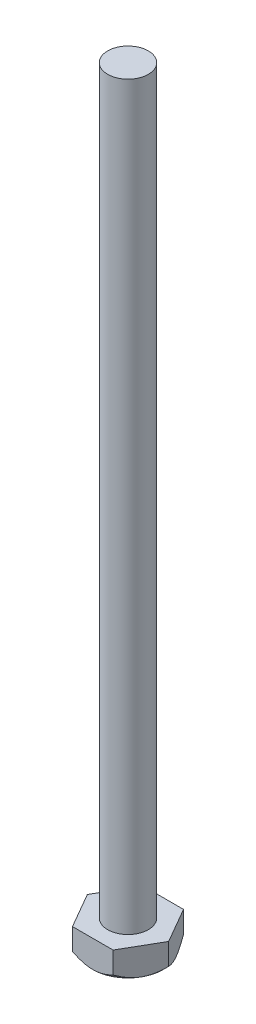
ISO-10303-21;
HEADER;
FILE_DESCRIPTION(('STEP AP214'),'2;1');
FILE_NAME('part.step','',(''),(''),'','','');
FILE_SCHEMA(('AUTOMOTIVE_DESIGN { 1 0 10303 214 1 1 1 1 }'));
ENDSEC;
DATA;
#1=APPLICATION_CONTEXT('core data for automotive mechanical design processes');
#2=APPLICATION_PROTOCOL_DEFINITION('international standard','automotive_design',2000,#1);
#3=PRODUCT_CONTEXT('',#1,'mechanical');
#4=PRODUCT('Part','Part','',(#3));
#5=PRODUCT_RELATED_PRODUCT_CATEGORY('part','',(#4));
#6=PRODUCT_DEFINITION_FORMATION('','',#4);
#7=PRODUCT_DEFINITION_CONTEXT('part definition',#1,'design');
#8=PRODUCT_DEFINITION('design','',#6,#7);
#9=PRODUCT_DEFINITION_SHAPE('','',#8);
#10=(LENGTH_UNIT() NAMED_UNIT(*) SI_UNIT(.MILLI.,.METRE.));
#11=(NAMED_UNIT(*) PLANE_ANGLE_UNIT() SI_UNIT($,.RADIAN.));
#12=(NAMED_UNIT(*) SI_UNIT($,.STERADIAN.) SOLID_ANGLE_UNIT());
#13=UNCERTAINTY_MEASURE_WITH_UNIT(LENGTH_MEASURE(1.E-05),#10,'distance_accuracy_value','');
#14=(GEOMETRIC_REPRESENTATION_CONTEXT(3) GLOBAL_UNCERTAINTY_ASSIGNED_CONTEXT((#13)) GLOBAL_UNIT_ASSIGNED_CONTEXT((#10,
#11,#12)) REPRESENTATION_CONTEXT('',''));
#15=CARTESIAN_POINT('',(0.,0.,0.));
#16=DIRECTION('',(0.,0.,1.));
#17=DIRECTION('',(1.,0.,0.));
#18=AXIS2_PLACEMENT_3D('',#15,#16,#17);
#19=CARTESIAN_POINT('',(-2.25000000000004,3.,-3.89711431702995));
#20=DIRECTION('',(0.866025403784441,0.,0.499999999999995));
#21=DIRECTION('',(0.499999999999995,0.,-0.866025403784441));
#22=AXIS2_PLACEMENT_3D('',#19,#20,#21);
#23=PLANE('',#22);
#24=DIRECTION('',(0.,-1.,0.));
#25=VECTOR('',#24,1.);
#26=CARTESIAN_POINT('',(-2.25000000000004,3.,-3.89711431702995));
#27=LINE('',#26,#25);
#28=CARTESIAN_POINT('',(-2.25000000000004,3.,-3.89711431702995));
#29=VERTEX_POINT('',#28);
#30=CARTESIAN_POINT('',(-2.25000000000004,0.602885682970011,-3.89711431702995));
#31=VERTEX_POINT('',#30);
#32=EDGE_CURVE('E223',#29,#31,#27,.T.);
#33=ORIENTED_EDGE('',*,*,#32,.T.);
#34=CARTESIAN_POINT('',(-2.24988452994621,0.60300115746818,-3.89731431702995));
#35=CARTESIAN_POINT('',(-2.28857392340009,0.564315683598842,-3.8303023218538));
#36=CARTESIAN_POINT('',(-2.32755938166385,0.526817058109167,-3.7627775273846));
#37=CARTESIAN_POINT('',(-2.40618341507805,0.454555279874753,-3.62659670681522));
#38=CARTESIAN_POINT('',(-2.44582233286502,0.419793621225151,-3.55794008725114));
#39=CARTESIAN_POINT('',(-2.56617907410039,0.31986029564012,-3.34947609639806));
#40=CARTESIAN_POINT('',(-2.64791981145258,0.2594666574207,-3.20789698625592));
#41=CARTESIAN_POINT('',(-2.81272459802907,0.156039411954947,-2.92244672257489));
#42=CARTESIAN_POINT('',(-2.89574701832528,0.112745349998774,-2.77864767245451));
#43=CARTESIAN_POINT('',(-3.06362512992859,0.0460360621055565,-2.48787425367886));
#44=CARTESIAN_POINT('',(-3.14847567973046,0.0225710650166898,-2.34090879037187));
#45=CARTESIAN_POINT('',(-3.29471210615064,0.0014001148011714,-2.08761986989481));
#46=CARTESIAN_POINT('',(-3.35590957059238,-0.00173316564486741,-1.98162275218732));
#47=CARTESIAN_POINT('',(-3.47820517363958,0.00354847531604555,-1.76980055416729));
#48=CARTESIAN_POINT('',(-3.53930326991011,0.0119674450049006,-1.66397554718099));
#49=CARTESIAN_POINT('',(-3.66092054700145,0.0398733753388013,-1.45332824418062));
#50=CARTESIAN_POINT('',(-3.72143900322301,0.0593727149732711,-1.34850720320923));
#51=CARTESIAN_POINT('',(-3.84143654501015,0.10837495265247,-1.14066536405054));
#52=CARTESIAN_POINT('',(-3.9009157098986,0.137877083706092,-1.03764442847197));
#53=CARTESIAN_POINT('',(-4.00650583131999,0.198574855137438,-0.854756973392748));
#54=CARTESIAN_POINT('',(-4.0528505586315,0.228174631860845,-0.774485551026299));
#55=CARTESIAN_POINT('',(-4.14470803625456,0.292144439286388,-0.615383732728023));
#56=CARTESIAN_POINT('',(-4.1902207612029,0.326514615138544,-0.536553380726601));
#57=CARTESIAN_POINT('',(-4.28027084260395,0.39925472178509,-0.380582064514261));
#58=CARTESIAN_POINT('',(-4.32481076024834,0.437612075019941,-0.303436664189242));
#59=CARTESIAN_POINT('',(-4.4130657627956,0.51782284154873,-0.150574515755275));
#60=CARTESIAN_POINT('',(-4.45678133385683,0.559674109887407,-0.0748569255953326));
#61=CARTESIAN_POINT('',(-4.50011547005384,0.603001157468207,0.000200000000000009));
#62=B_SPLINE_CURVE_WITH_KNOTS('',3,(#34,#35,#36,#37,#38,#39,#40,#41,#42,#43,#44,#45,#46,#47,#48,
#49,#50,#51,#52,#53,#54,#55,#56,#57,#58,#59,#60,#61),.UNSPECIFIED.,.F.,.F.,(4,2,2,2,2,2,2,2,2,2,
2,2,2,4),(0.,0.259511456949191,0.519163611469622,1.04127151253343,1.55508809846443,
2.06761113620425,2.43439809583154,2.80131362229781,3.16863987499371,3.53593796832224,
3.82770408759527,4.1194790864494,4.41036011166254,4.70106385660935),.UNSPECIFIED.);
#63=CARTESIAN_POINT('',(-3.375,0.,-1.94855715851499));
#64=VERTEX_POINT('',#63);
#65=EDGE_CURVE('E63',#31,#64,#62,.T.);
#66=ORIENTED_EDGE('',*,*,#65,.T.);
#67=CARTESIAN_POINT('',(-4.5,0.602885682970039,0.));
#68=VERTEX_POINT('',#67);
#69=EDGE_CURVE('E191',#64,#68,#62,.T.);
#70=ORIENTED_EDGE('',*,*,#69,.T.);
#71=DIRECTION('',(0.,-1.,0.));
#72=VECTOR('',#71,1.);
#73=CARTESIAN_POINT('',(-4.5,3.,0.));
#74=LINE('',#73,#72);
#75=CARTESIAN_POINT('',(-4.5,3.,0.));
#76=VERTEX_POINT('',#75);
#77=EDGE_CURVE('E242',#76,#68,#74,.T.);
#78=ORIENTED_EDGE('',*,*,#77,.F.);
#79=DIRECTION('',(-0.499999999999995,0.,0.866025403784441));
#80=VECTOR('',#79,1.);
#81=CARTESIAN_POINT('',(-2.25000000000004,3.,-3.89711431702995));
#82=LINE('',#81,#80);
#83=EDGE_CURVE('E227',#29,#76,#82,.T.);
#84=ORIENTED_EDGE('',*,*,#83,.F.);
#85=EDGE_LOOP('',(#33,#66,#70,#78,#84));
#86=FACE_BOUND('',#85,.T.);
#87=ADVANCED_FACE('F41',(#86),#23,.F.);
#88=CARTESIAN_POINT('',(-4.5,3.,0.));
#89=DIRECTION('',(0.866025403784438,0.,-0.500000000000001));
#90=DIRECTION('',(-0.500000000000001,0.,-0.866025403784438));
#91=AXIS2_PLACEMENT_3D('',#88,#89,#90);
#92=PLANE('',#91);
#93=ORIENTED_EDGE('',*,*,#77,.T.);
#94=CARTESIAN_POINT('',(-4.50011547005384,0.603001157468207,-0.000200000000000061));
#95=CARTESIAN_POINT('',(-4.46142607659996,0.564315683598869,0.0668119951761429));
#96=CARTESIAN_POINT('',(-4.42244061833619,0.526817058109193,0.134336789645346));
#97=CARTESIAN_POINT('',(-4.34381658492199,0.454555279874777,0.270517610214731));
#98=CARTESIAN_POINT('',(-4.30417766713502,0.419793621225175,0.339174229778811));
#99=CARTESIAN_POINT('',(-4.18382092589965,0.319860295640143,0.547638220631886));
#100=CARTESIAN_POINT('',(-4.10208018854746,0.259466657420722,0.689217330774031));
#101=CARTESIAN_POINT('',(-3.93727540197096,0.156039411954968,0.974667594455061));
#102=CARTESIAN_POINT('',(-3.85425298167475,0.112745349998794,1.11846664457544));
#103=CARTESIAN_POINT('',(-3.68637487007144,0.0460360621055745,1.40924006335109));
#104=CARTESIAN_POINT('',(-3.60152432026957,0.0225710650167067,1.55620552665809));
#105=CARTESIAN_POINT('',(-3.45528789384939,0.00140011480118764,1.80949444713515));
#106=CARTESIAN_POINT('',(-3.39409042940764,-0.00173316564485114,1.91549156484264));
#107=CARTESIAN_POINT('',(-3.27179482636044,0.0035484753160612,2.12731376286267));
#108=CARTESIAN_POINT('',(-3.21069673008991,0.0119674450049156,2.23313876984896));
#109=CARTESIAN_POINT('',(-3.08907945299857,0.0398733753388158,2.44378607284934));
#110=CARTESIAN_POINT('',(-3.028560996777,0.0593727149732858,2.54860711382073));
#111=CARTESIAN_POINT('',(-2.90856345498987,0.108374952652485,2.75644895297942));
#112=CARTESIAN_POINT('',(-2.84908429010141,0.137877083706107,2.85946988855799));
#113=CARTESIAN_POINT('',(-2.74349416868002,0.198574855137453,3.04235734363721));
#114=CARTESIAN_POINT('',(-2.69714944136851,0.22817463186086,3.12262876600366));
#115=CARTESIAN_POINT('',(-2.60529196374544,0.292144439286405,3.28173058430194));
#116=CARTESIAN_POINT('',(-2.55977923879711,0.326514615138562,3.36056093630337));
#117=CARTESIAN_POINT('',(-2.46972915739605,0.399254721785111,3.51653225251571));
#118=CARTESIAN_POINT('',(-2.42518923975166,0.437612075019963,3.59367765284073));
#119=CARTESIAN_POINT('',(-2.3369342372044,0.517822841548755,3.7465398012747));
#120=CARTESIAN_POINT('',(-2.29321866614317,0.559674109887433,3.82225739143464));
#121=CARTESIAN_POINT('',(-2.24988452994615,0.603001157468234,3.89731431702998));
#122=B_SPLINE_CURVE_WITH_KNOTS('',3,(#94,#95,#96,#97,#98,#99,#100,#101,#102,#103,#104,#105,#106,
#107,#108,#109,#110,#111,#112,#113,#114,#115,#116,#117,#118,#119,#120,#121),.UNSPECIFIED.,.F.,
.F.,(4,2,2,2,2,2,2,2,2,2,2,2,2,4),(0.,0.259511456949194,0.519163611469628,1.04127151253344,
1.55508809846445,2.06761113620427,2.43439809583156,2.80131362229784,3.16863987499374,
3.53593796832227,3.8277040875953,4.11947908644945,4.4103601116626,4.70106385660941),.UNSPECIFIED.);
#123=CARTESIAN_POINT('',(-3.37499999999999,0.,1.94855715851495));
#124=VERTEX_POINT('',#123);
#125=EDGE_CURVE('E189',#68,#124,#122,.T.);
#126=ORIENTED_EDGE('',*,*,#125,.T.);
#127=CARTESIAN_POINT('',(-2.24999999999999,0.602885682970066,3.89711431702998));
#128=VERTEX_POINT('',#127);
#129=EDGE_CURVE('E183',#124,#128,#122,.T.);
#130=ORIENTED_EDGE('',*,*,#129,.T.);
#131=DIRECTION('',(0.,-1.,0.));
#132=VECTOR('',#131,1.);
#133=CARTESIAN_POINT('',(-2.24999999999999,3.,3.89711431702998));
#134=LINE('',#133,#132);
#135=CARTESIAN_POINT('',(-2.24999999999999,3.,3.89711431702998));
#136=VERTEX_POINT('',#135);
#137=EDGE_CURVE('E240',#136,#128,#134,.T.);
#138=ORIENTED_EDGE('',*,*,#137,.F.);
#139=DIRECTION('',(0.500000000000001,0.,0.866025403784438));
#140=VECTOR('',#139,1.);
#141=CARTESIAN_POINT('',(-4.5,3.,0.));
#142=LINE('',#141,#140);
#143=EDGE_CURVE('E253',#76,#136,#142,.T.);
#144=ORIENTED_EDGE('',*,*,#143,.F.);
#145=EDGE_LOOP('',(#93,#126,#130,#138,#144));
#146=FACE_BOUND('',#145,.T.);
#147=ADVANCED_FACE('F197',(#146),#92,.F.);
#148=CARTESIAN_POINT('',(-2.24999999999999,3.,3.89711431702998));
#149=DIRECTION('',(0.,0.,-1.));
#150=DIRECTION('',(-1.,0.,0.));
#151=AXIS2_PLACEMENT_3D('',#148,#149,#150);
#152=PLANE('',#151);
#153=ORIENTED_EDGE('',*,*,#137,.T.);
#154=CARTESIAN_POINT('',(-6.85997222864644,3.99254467292652,3.89711431702999));
#155=CARTESIAN_POINT('',(-6.75872004894412,3.90450931202217,3.89711431702999));
#156=CARTESIAN_POINT('',(-6.65723485497251,3.81674191735845,3.89711431702999));
#157=CARTESIAN_POINT('',(-6.4537364104748,3.64181829269082,3.89711431702999));
#158=CARTESIAN_POINT('',(-6.35172315150067,3.55466207251736,3.89711431702999));
#159=CARTESIAN_POINT('',(-6.04471001249466,3.29414825018533,3.89711431702999));
#160=CARTESIAN_POINT('',(-5.83882880607191,3.12182574373336,3.89711431702999));
#161=CARTESIAN_POINT('',(-5.41947564295796,2.77698805930476,3.89711431702999));
#162=CARTESIAN_POINT('',(-5.20593673766898,2.60455400710487,3.89711431702999));
#163=CARTESIAN_POINT('',(-4.77488643132983,2.2648199704903,3.89711431702999));
#164=CARTESIAN_POINT('',(-4.55737603395738,2.09751871679145,3.89711431702999));
#165=CARTESIAN_POINT('',(-4.11677158743131,1.76976355787984,3.89711431702998));
#166=CARTESIAN_POINT('',(-3.89367085331293,1.6093185385476,3.89711431702998));
#167=CARTESIAN_POINT('',(-3.55361805163421,1.37630388850876,3.89711431702998));
#168=CARTESIAN_POINT('',(-3.43931237137392,1.29987402843667,3.89711431702998));
#169=CARTESIAN_POINT('',(-3.20864728176638,1.15018196609729,3.89711431702998));
#170=CARTESIAN_POINT('',(-3.09228800897874,1.07691955431059,3.89711431702998));
#171=CARTESIAN_POINT('',(-2.85805021732411,0.934795137980553,3.89711431702998));
#172=CARTESIAN_POINT('',(-2.74018873657671,0.86590517785101,3.89711431702998));
#173=CARTESIAN_POINT('',(-2.50178862443397,0.732859675355035,3.89711431702998));
#174=CARTESIAN_POINT('',(-2.38124967225006,0.668704704312785,3.89711431702998));
#175=CARTESIAN_POINT('',(-2.13737280821359,0.546392335210151,3.89711431702998));
#176=CARTESIAN_POINT('',(-2.01403943645704,0.488225955894624,3.89711431702998));
#177=CARTESIAN_POINT('',(-1.7641774041417,0.379238229057955,3.89711431702998));
#178=CARTESIAN_POINT('',(-1.63764961907404,0.328414894161285,3.89711431702998));
#179=CARTESIAN_POINT('',(-1.37837666128282,0.234772801074191,3.89711431702998));
#180=CARTESIAN_POINT('',(-1.24555558375378,0.192161263138968,3.89711431702997));
#181=CARTESIAN_POINT('',(-0.976723782142934,0.118455910747037,3.89711431702997));
#182=CARTESIAN_POINT('',(-0.840713569426529,0.0873602630105727,3.89711431702997));
#183=CARTESIAN_POINT('',(-0.567147529867146,0.0387691626064548,3.89711431702997));
#184=CARTESIAN_POINT('',(-0.429607459728064,0.0211867667628479,3.89711431702997));
#185=CARTESIAN_POINT('',(-0.153432484230891,0.00058968948204515,3.89711431702997));
#186=CARTESIAN_POINT('',(-0.0147977123148992,-0.00242674087741944,3.89711431702997));
#187=CARTESIAN_POINT('',(0.262261756890505,0.00635419376116221,3.89711431702997));
#188=CARTESIAN_POINT('',(0.400685518210838,0.0181804406342243,3.89711431702997));
#189=CARTESIAN_POINT('',(0.675611780835354,0.0557810516949724,3.89711431702997));
#190=CARTESIAN_POINT('',(0.812113884804431,0.0815582582501611,3.89711431702997));
#191=CARTESIAN_POINT('',(1.0831684131717,0.145565470000884,3.89711431702997));
#192=CARTESIAN_POINT('',(1.21769925755864,0.183885230879357,3.89711431702997));
#193=CARTESIAN_POINT('',(1.483325931393,0.270858014295512,3.89711431702997));
#194=CARTESIAN_POINT('',(1.61442168621562,0.319511261111828,3.89711431702997));
#195=CARTESIAN_POINT('',(1.90016841788084,0.43621496261043,3.89711431702996));
#196=CARTESIAN_POINT('',(2.05402453299604,0.506194463366237,3.89711431702996));
#197=CARTESIAN_POINT('',(2.35716987014355,0.655504328004548,3.89711431702996));
#198=CARTESIAN_POINT('',(2.50645642068026,0.734840035067124,3.89711431702996));
#199=CARTESIAN_POINT('',(2.80129692467606,0.900790584026616,3.89711431702996));
#200=CARTESIAN_POINT('',(2.94684260269971,0.987420008714851,3.89711431702996));
#201=CARTESIAN_POINT('',(3.23447290564426,1.16614816901466,3.89711431702996));
#202=CARTESIAN_POINT('',(3.37655820249207,1.25824583068463,3.89711431702996));
#203=CARTESIAN_POINT('',(3.65861400374144,1.44722304089241,3.89711431702996));
#204=CARTESIAN_POINT('',(3.79856890581237,1.54412576675115,3.89711431702996));
#205=CARTESIAN_POINT('',(4.07605297023888,1.74134188071222,3.89711431702996));
#206=CARTESIAN_POINT('',(4.21358204609701,1.84165539006066,3.89711431702996));
#207=CARTESIAN_POINT('',(4.48644515394262,2.04488963428453,3.89711431702996));
#208=CARTESIAN_POINT('',(4.62178156094305,2.14780718885647,3.89711431702996));
#209=CARTESIAN_POINT('',(4.8907443910255,2.35585627240593,3.89711431702995));
#210=CARTESIAN_POINT('',(5.02437075692599,2.46098787510893,3.89711431702995));
#211=CARTESIAN_POINT('',(5.44828680963716,2.79918006792363,3.89711431702995));
#212=CARTESIAN_POINT('',(5.7358529081179,3.03565639479908,3.89711431702995));
#213=CARTESIAN_POINT('',(6.16190550240122,3.39334640966446,3.89711431702995));
#214=CARTESIAN_POINT('',(6.30224505256875,3.5123767879147,3.89711431702995));
#215=CARTESIAN_POINT('',(6.58185843864304,3.75161900099287,3.89711431702995));
#216=CARTESIAN_POINT('',(6.72113251072079,3.87183055966444,3.89711431702995));
#217=CARTESIAN_POINT('',(6.85997222864647,3.99254467292652,3.89711431702995));
#218=B_SPLINE_CURVE_WITH_KNOTS('',3,(#154,#155,#156,#157,#158,#159,#160,#161,#162,#163,#164,
#165,#166,#167,#168,#169,#170,#171,#172,#173,#174,#175,#176,#177,#178,#179,#180,#181,#182,#183,
#184,#185,#186,#187,#188,#189,#190,#191,#192,#193,#194,#195,#196,#197,#198,#199,#200,#201,#202,
#203,#204,#205,#206,#207,#208,#209,#210,#211,#212,#213,#214,#215,#216,#217),.UNSPECIFIED.,.F.,
.F.,(4,2,2,2,2,2,2,2,2,2,2,2,2,2,2,2,2,2,2,2,2,2,2,2,2,2,2,2,2,2,2,4),(0.,0.402516401063878,
0.805039261633803,1.61045129809907,2.43379477124844,3.25693297215988,4.0811074907866,
4.49357889826874,4.90602297984403,5.31548875880244,5.72500386343779,6.13389557576763,
6.54267641449962,6.96070991509834,7.37867683794105,7.79393154623545,8.20913639403359,
8.62515042930018,9.04124925516079,9.46039331801311,9.87954647892449,10.3861886113143,
10.8931214929589,11.4010931476656,11.9089653665037,12.4195855546203,12.9302239132149,
13.4402661671707,13.9503254319381,15.0671169384041,15.6191745039842,16.1711059339277),.UNSPECIFIED.);
#219=CARTESIAN_POINT('',(0.,0.,3.89711431702993));
#220=VERTEX_POINT('',#219);
#221=EDGE_CURVE('E190',#128,#220,#218,.T.);
#222=ORIENTED_EDGE('',*,*,#221,.T.);
#223=CARTESIAN_POINT('',(2.25000000000002,0.602885682970066,3.89711431702996));
#224=VERTEX_POINT('',#223);
#225=EDGE_CURVE('E176',#220,#224,#218,.T.);
#226=ORIENTED_EDGE('',*,*,#225,.T.);
#227=DIRECTION('',(0.,-1.,0.));
#228=VECTOR('',#227,1.);
#229=CARTESIAN_POINT('',(2.25000000000002,3.,3.89711431702996));
#230=LINE('',#229,#228);
#231=CARTESIAN_POINT('',(2.25000000000002,3.,3.89711431702996));
#232=VERTEX_POINT('',#231);
#233=EDGE_CURVE('E237',#232,#224,#230,.T.);
#234=ORIENTED_EDGE('',*,*,#233,.F.);
#235=DIRECTION('',(1.,0.,0.));
#236=VECTOR('',#235,1.);
#237=CARTESIAN_POINT('',(-2.24999999999999,3.,3.89711431702998));
#238=LINE('',#237,#236);
#239=EDGE_CURVE('E255',#136,#232,#238,.T.);
#240=ORIENTED_EDGE('',*,*,#239,.F.);
#241=EDGE_LOOP('',(#153,#222,#226,#234,#240));
#242=FACE_BOUND('',#241,.T.);
#243=ADVANCED_FACE('F200',(#242),#152,.F.);
#244=CARTESIAN_POINT('',(2.25000000000002,3.,3.89711431702996));
#245=DIRECTION('',(-0.866025403784441,0.,-0.499999999999995));
#246=DIRECTION('',(-0.499999999999995,0.,0.866025403784442));
#247=AXIS2_PLACEMENT_3D('',#244,#245,#246);
#248=PLANE('',#247);
#249=ORIENTED_EDGE('',*,*,#233,.T.);
#250=CARTESIAN_POINT('',(2.24988452994618,0.603001157468234,3.89731431702996));
#251=CARTESIAN_POINT('',(2.28857392340006,0.564315683598895,3.83030232185382));
#252=CARTESIAN_POINT('',(2.32755938166383,0.526817058109217,3.76277752738461));
#253=CARTESIAN_POINT('',(2.40618341507803,0.454555279874799,3.62659670681523));
#254=CARTESIAN_POINT('',(2.445822332865,0.419793621225196,3.55794008725114));
#255=CARTESIAN_POINT('',(2.56617907410037,0.319860295640159,3.34947609639806));
#256=CARTESIAN_POINT('',(2.64791981145256,0.259466657420735,3.20789698625591));
#257=CARTESIAN_POINT('',(2.81272459802906,0.156039411954976,2.92244672257488));
#258=CARTESIAN_POINT('',(2.89574701832527,0.1127453499988,2.77864767245449));
#259=CARTESIAN_POINT('',(3.06362512992859,0.0460360621055764,2.48787425367883));
#260=CARTESIAN_POINT('',(3.14847567973046,0.0225710650167071,2.34090879037183));
#261=CARTESIAN_POINT('',(3.29471210615064,0.00140011480118726,2.08761986989477));
#262=CARTESIAN_POINT('',(3.35590957059238,-0.00173316564485156,1.98162275218728));
#263=CARTESIAN_POINT('',(3.47820517363959,0.00354847531606071,1.76980055416724));
#264=CARTESIAN_POINT('',(3.53930326991012,0.0119674450049151,1.66397554718095));
#265=CARTESIAN_POINT('',(3.66092054700145,0.0398733753388147,1.45332824418057));
#266=CARTESIAN_POINT('',(3.72143900322302,0.0593727149732843,1.34850720320918));
#267=CARTESIAN_POINT('',(3.84143654501015,0.108374952652483,1.14066536405049));
#268=CARTESIAN_POINT('',(3.90091570989861,0.137877083706104,1.03764442847192));
#269=CARTESIAN_POINT('',(4.00650583132,0.198574855137449,0.854756973392703));
#270=CARTESIAN_POINT('',(4.0528505586315,0.228174631860855,0.774485551026255));
#271=CARTESIAN_POINT('',(4.14470803625457,0.292144439286396,0.615383732727982));
#272=CARTESIAN_POINT('',(4.1902207612029,0.326514615138551,0.536553380726561));
#273=CARTESIAN_POINT('',(4.28027084260395,0.399254721785095,0.380582064514223));
#274=CARTESIAN_POINT('',(4.32481076024834,0.437612075019945,0.303436664189206));
#275=CARTESIAN_POINT('',(4.4130657627956,0.517822841548732,0.150574515755241));
#276=CARTESIAN_POINT('',(4.45678133385683,0.559674109887408,0.0748569255953001));
#277=CARTESIAN_POINT('',(4.50011547005384,0.603001157468206,-0.000200000000031508));
#278=B_SPLINE_CURVE_WITH_KNOTS('',3,(#250,#251,#252,#253,#254,#255,#256,#257,#258,#259,#260,
#261,#262,#263,#264,#265,#266,#267,#268,#269,#270,#271,#272,#273,#274,#275,#276,#277),
.UNSPECIFIED.,.F.,.F.,(4,2,2,2,2,2,2,2,2,2,2,2,2,4),(0.,0.259511456949199,0.51916361146964,
1.04127151253346,1.55508809846448,2.06761113620432,2.43439809583161,2.80131362229789,
3.16863987499379,3.53593796832232,3.82770408759534,4.11947908644947,4.41036011166261,
4.70106385660941),.UNSPECIFIED.);
#279=CARTESIAN_POINT('',(3.375,0.,1.94855715851493));
#280=VERTEX_POINT('',#279);
#281=EDGE_CURVE('E264',#224,#280,#278,.T.);
#282=ORIENTED_EDGE('',*,*,#281,.T.);
#283=CARTESIAN_POINT('',(4.5,0.602885682970038,0.));
#284=VERTEX_POINT('',#283);
#285=EDGE_CURVE('E169',#280,#284,#278,.T.);
#286=ORIENTED_EDGE('',*,*,#285,.T.);
#287=DIRECTION('',(0.,-1.,0.));
#288=VECTOR('',#287,1.);
#289=CARTESIAN_POINT('',(4.5,3.,0.));
#290=LINE('',#289,#288);
#291=CARTESIAN_POINT('',(4.5,3.,0.));
#292=VERTEX_POINT('',#291);
#293=EDGE_CURVE('E230',#292,#284,#290,.T.);
#294=ORIENTED_EDGE('',*,*,#293,.F.);
#295=DIRECTION('',(0.499999999999995,0.,-0.866025403784442));
#296=VECTOR('',#295,1.);
#297=CARTESIAN_POINT('',(2.25000000000002,3.,3.89711431702996));
#298=LINE('',#297,#296);
#299=EDGE_CURVE('E257',#232,#292,#298,.T.);
#300=ORIENTED_EDGE('',*,*,#299,.F.);
#301=EDGE_LOOP('',(#249,#282,#286,#294,#300));
#302=FACE_BOUND('',#301,.T.);
#303=ADVANCED_FACE('F204',(#302),#248,.F.);
#304=CARTESIAN_POINT('',(4.5,3.,0.));
#305=DIRECTION('',(-0.866025403784435,0.,0.500000000000007));
#306=DIRECTION('',(0.500000000000007,0.,0.866025403784435));
#307=AXIS2_PLACEMENT_3D('',#304,#305,#306);
#308=PLANE('',#307);
#309=ORIENTED_EDGE('',*,*,#293,.T.);
#310=CARTESIAN_POINT('',(4.50011547005384,0.603001157468206,0.00019999999996861));
#311=CARTESIAN_POINT('',(4.46142607659996,0.564315683598867,-0.0668119951761756));
#312=CARTESIAN_POINT('',(4.42244061833619,0.526817058109189,-0.13433678964538));
#313=CARTESIAN_POINT('',(4.34381658492198,0.45455527987477,-0.270517610214767));
#314=CARTESIAN_POINT('',(4.30417766713501,0.419793621225167,-0.339174229778848));
#315=CARTESIAN_POINT('',(4.18382092589964,0.319860295640129,-0.547638220631926));
#316=CARTESIAN_POINT('',(4.10208018854744,0.259466657420705,-0.689217330774074));
#317=CARTESIAN_POINT('',(3.93727540197094,0.156039411954945,-0.974667594455109));
#318=CARTESIAN_POINT('',(3.85425298167473,0.112745349998769,-1.11846664457549));
#319=CARTESIAN_POINT('',(3.68637487007141,0.0460360621055456,-1.40924006335115));
#320=CARTESIAN_POINT('',(3.60152432026954,0.0225710650166763,-1.55620552665815));
#321=CARTESIAN_POINT('',(3.45528789384935,0.00140011480115649,-1.80949444713521));
#322=CARTESIAN_POINT('',(3.39409042940761,-0.00173316564488229,-1.9154915648427));
#323=CARTESIAN_POINT('',(3.2717948263604,0.00354847531602951,-2.12731376286273));
#324=CARTESIAN_POINT('',(3.21069673008987,0.0119674450048834,-2.23313876984902));
#325=CARTESIAN_POINT('',(3.08907945299853,0.0398733753387824,-2.4437860728494));
#326=CARTESIAN_POINT('',(3.02856099677697,0.0593727149732519,-2.54860711382078));
#327=CARTESIAN_POINT('',(2.90856345498983,0.10837495265245,-2.75644895297947));
#328=CARTESIAN_POINT('',(2.84908429010137,0.137877083706071,-2.85946988855804));
#329=CARTESIAN_POINT('',(2.74349416867998,0.198574855137416,-3.04235734363726));
#330=CARTESIAN_POINT('',(2.69714944136847,0.228174631860823,-3.12262876600371));
#331=CARTESIAN_POINT('',(2.60529196374541,0.292144439286365,-3.28173058430198));
#332=CARTESIAN_POINT('',(2.55977923879707,0.32651461513852,-3.3605609363034));
#333=CARTESIAN_POINT('',(2.46972915739602,0.399254721785067,-3.51653225251574));
#334=CARTESIAN_POINT('',(2.42518923975163,0.437612075019917,-3.59367765284076));
#335=CARTESIAN_POINT('',(2.33693423720437,0.517822841548706,-3.74653980127472));
#336=CARTESIAN_POINT('',(2.29321866614314,0.559674109887382,-3.82225739143466));
#337=CARTESIAN_POINT('',(2.24988452994613,0.603001157468181,-3.89731431702999));
#338=B_SPLINE_CURVE_WITH_KNOTS('',3,(#310,#311,#312,#313,#314,#315,#316,#317,#318,#319,#320,
#321,#322,#323,#324,#325,#326,#327,#328,#329,#330,#331,#332,#333,#334,#335,#336,#337),
.UNSPECIFIED.,.F.,.F.,(4,2,2,2,2,2,2,2,2,2,2,2,2,4),(0.,0.2595114569492,0.519163611469641,
1.04127151253346,1.55508809846448,2.06761113620432,2.43439809583161,2.80131362229788,
3.16863987499378,3.53593796832231,3.82770408759533,4.11947908644947,4.41036011166261,
4.70106385660941),.UNSPECIFIED.);
#339=CARTESIAN_POINT('',(3.37499999999998,0.,-1.94855715851504));
#340=VERTEX_POINT('',#339);
#341=EDGE_CURVE('E141',#284,#340,#338,.T.);
#342=ORIENTED_EDGE('',*,*,#341,.T.);
#343=CARTESIAN_POINT('',(2.24999999999996,0.602885682970012,-3.89711431702999));
#344=VERTEX_POINT('',#343);
#345=EDGE_CURVE('E126',#340,#344,#338,.T.);
#346=ORIENTED_EDGE('',*,*,#345,.T.);
#347=DIRECTION('',(0.,-1.,0.));
#348=VECTOR('',#347,1.);
#349=CARTESIAN_POINT('',(2.24999999999996,3.,-3.89711431702999));
#350=LINE('',#349,#348);
#351=CARTESIAN_POINT('',(2.24999999999996,3.,-3.89711431702999));
#352=VERTEX_POINT('',#351);
#353=EDGE_CURVE('E140',#352,#344,#350,.T.);
#354=ORIENTED_EDGE('',*,*,#353,.F.);
#355=DIRECTION('',(-0.500000000000007,0.,-0.866025403784435));
#356=VECTOR('',#355,1.);
#357=CARTESIAN_POINT('',(4.5,3.,0.));
#358=LINE('',#357,#356);
#359=EDGE_CURVE('E232',#292,#352,#358,.T.);
#360=ORIENTED_EDGE('',*,*,#359,.F.);
#361=EDGE_LOOP('',(#309,#342,#346,#354,#360));
#362=FACE_BOUND('',#361,.T.);
#363=ADVANCED_FACE('F208',(#362),#308,.F.);
#364=CARTESIAN_POINT('',(2.24999999999996,3.,-3.89711431702999));
#365=DIRECTION('',(0.,0.,1.));
#366=DIRECTION('',(1.,0.,0.));
#367=AXIS2_PLACEMENT_3D('',#364,#365,#366);
#368=PLANE('',#367);
#369=ORIENTED_EDGE('',*,*,#353,.T.);
#370=CARTESIAN_POINT('',(6.85997222864642,3.99254467292649,-3.89711431703004));
#371=CARTESIAN_POINT('',(6.75872004894409,3.90450931202214,-3.89711431703004));
#372=CARTESIAN_POINT('',(6.65723485497249,3.81674191735842,-3.89711431703004));
#373=CARTESIAN_POINT('',(6.45373641047477,3.64181829269079,-3.89711431703004));
#374=CARTESIAN_POINT('',(6.35172315150065,3.55466207251732,-3.89711431703004));
#375=CARTESIAN_POINT('',(6.04471001249463,3.29414825018529,-3.89711431703003));
#376=CARTESIAN_POINT('',(5.83882880607189,3.12182574373333,-3.89711431703003));
#377=CARTESIAN_POINT('',(5.41947564295794,2.77698805930473,-3.89711431703003));
#378=CARTESIAN_POINT('',(5.20593673766895,2.60455400710484,-3.89711431703003));
#379=CARTESIAN_POINT('',(4.77488643132982,2.26481997049027,-3.89711431703002));
#380=CARTESIAN_POINT('',(4.55737603395737,2.09751871679142,-3.89711431703002));
#381=CARTESIAN_POINT('',(4.11677158743129,1.76976355787981,-3.89711431703001));
#382=CARTESIAN_POINT('',(3.89367085331292,1.60931853854757,-3.89711431703001));
#383=CARTESIAN_POINT('',(3.5536180516342,1.37630388850872,-3.89711431703001));
#384=CARTESIAN_POINT('',(3.43931237137391,1.29987402843664,-3.89711431703001));
#385=CARTESIAN_POINT('',(3.20864728176637,1.15018196609725,-3.89711431703));
#386=CARTESIAN_POINT('',(3.09228800897874,1.07691955431055,-3.89711431703));
#387=CARTESIAN_POINT('',(2.85805021732411,0.934795137980515,-3.89711431703));
#388=CARTESIAN_POINT('',(2.74018873657671,0.865905177850971,-3.89711431703));
#389=CARTESIAN_POINT('',(2.50178862443397,0.732859675354995,-3.89711431703));
#390=CARTESIAN_POINT('',(2.38124967225006,0.668704704312744,-3.89711431703));
#391=CARTESIAN_POINT('',(2.13737280821359,0.546392335210109,-3.89711431702999));
#392=CARTESIAN_POINT('',(2.01403943645704,0.488225955894581,-3.89711431702999));
#393=CARTESIAN_POINT('',(1.76417740414169,0.379238229057909,-3.89711431702999));
#394=CARTESIAN_POINT('',(1.63764961907404,0.328414894161238,-3.89711431702999));
#395=CARTESIAN_POINT('',(1.37837666128282,0.234772801074142,-3.89711431702999));
#396=CARTESIAN_POINT('',(1.24555558375378,0.192161263138917,-3.89711431702998));
#397=CARTESIAN_POINT('',(0.976723782142937,0.118455910746984,-3.89711431702998));
#398=CARTESIAN_POINT('',(0.840713569426532,0.0873602630105178,-3.89711431702998));
#399=CARTESIAN_POINT('',(0.567147529867151,0.0387691626063974,-3.89711431702998));
#400=CARTESIAN_POINT('',(0.429607459728069,0.0211867667627892,-3.89711431702997));
#401=CARTESIAN_POINT('',(0.153432484230898,0.000589689481984111,-3.89711431702997));
#402=CARTESIAN_POINT('',(0.0147977123149065,-0.00242674087748152,-3.89711431702997));
#403=CARTESIAN_POINT('',(-0.262261756890496,0.00635419376109748,-3.89711431702997));
#404=CARTESIAN_POINT('',(-0.400685518210829,0.018180440634158,-3.89711431702997));
#405=CARTESIAN_POINT('',(-0.675611780835345,0.0557810516949039,-3.89711431702996));
#406=CARTESIAN_POINT('',(-0.812113884804422,0.0815582582500921,-3.89711431702996));
#407=CARTESIAN_POINT('',(-1.08316841317169,0.145565470000813,-3.89711431702996));
#408=CARTESIAN_POINT('',(-1.21769925755863,0.183885230879285,-3.89711431702996));
#409=CARTESIAN_POINT('',(-1.48332593139299,0.27085801429544,-3.89711431702995));
#410=CARTESIAN_POINT('',(-1.61442168621561,0.319511261111755,-3.89711431702995));
#411=CARTESIAN_POINT('',(-1.90016841788082,0.436214962610356,-3.89711431702995));
#412=CARTESIAN_POINT('',(-2.05402453299602,0.50619446336616,-3.89711431702995));
#413=CARTESIAN_POINT('',(-2.35716987014353,0.655504328004468,-3.89711431702995));
#414=CARTESIAN_POINT('',(-2.50645642068023,0.73484003506704,-3.89711431702994));
#415=CARTESIAN_POINT('',(-2.80129692467603,0.900790584026529,-3.89711431702994));
#416=CARTESIAN_POINT('',(-2.94684260269967,0.987420008714761,-3.89711431702994));
#417=CARTESIAN_POINT('',(-3.23447290564421,1.16614816901457,-3.89711431702994));
#418=CARTESIAN_POINT('',(-3.37655820249202,1.25824583068453,-3.89711431702993));
#419=CARTESIAN_POINT('',(-3.65861400374139,1.44722304089231,-3.89711431702993));
#420=CARTESIAN_POINT('',(-3.79856890581231,1.54412576675104,-3.89711431702993));
#421=CARTESIAN_POINT('',(-4.07605297023881,1.74134188071211,-3.89711431702993));
#422=CARTESIAN_POINT('',(-4.21358204609694,1.84165539006055,-3.89711431702993));
#423=CARTESIAN_POINT('',(-4.48644515394255,2.04488963428441,-3.89711431702992));
#424=CARTESIAN_POINT('',(-4.62178156094298,2.14780718885635,-3.89711431702992));
#425=CARTESIAN_POINT('',(-4.89074439102542,2.35585627240581,-3.89711431702992));
#426=CARTESIAN_POINT('',(-5.0243707569259,2.4609878751088,-3.89711431702992));
#427=CARTESIAN_POINT('',(-5.44828680963709,2.79918006792351,-3.89711431702991));
#428=CARTESIAN_POINT('',(-5.73585290811785,3.03565639479898,-3.89711431702991));
#429=CARTESIAN_POINT('',(-6.1619055024012,3.39334640966439,-3.89711431702991));
#430=CARTESIAN_POINT('',(-6.30224505256874,3.51237678791463,-3.8971143170299));
#431=CARTESIAN_POINT('',(-6.58185843864305,3.75161900099282,-3.8971143170299));
#432=CARTESIAN_POINT('',(-6.72113251072081,3.8718305596644,-3.8971143170299));
#433=CARTESIAN_POINT('',(-6.8599722286465,3.99254467292649,-3.8971143170299));
#434=B_SPLINE_CURVE_WITH_KNOTS('',3,(#370,#371,#372,#373,#374,#375,#376,#377,#378,#379,#380,
#381,#382,#383,#384,#385,#386,#387,#388,#389,#390,#391,#392,#393,#394,#395,#396,#397,#398,#399,
#400,#401,#402,#403,#404,#405,#406,#407,#408,#409,#410,#411,#412,#413,#414,#415,#416,#417,#418,
#419,#420,#421,#422,#423,#424,#425,#426,#427,#428,#429,#430,#431,#432,#433),.UNSPECIFIED.,.F.,
.F.,(4,2,2,2,2,2,2,2,2,2,2,2,2,2,2,2,2,2,2,2,2,2,2,2,2,2,2,2,2,2,2,4),(0.,0.402516401063879,
0.805039261633802,1.61045129809907,2.43379477124844,3.25693297215988,4.08110749078659,
4.49357889826873,4.90602297984402,5.31548875880243,5.72500386343778,6.13389557576762,
6.54267641449961,6.96070991509832,7.37867683794103,7.79393154623543,8.20913639403357,
8.62515042930016,9.04124925516077,9.46039331801308,9.87954647892447,10.3861886113143,
10.8931214929589,11.4010931476656,11.9089653665037,12.4195855546202,12.9302239132148,
13.4402661671706,13.950325431938,15.067116938404,15.6191745039842,16.1711059339277),.UNSPECIFIED.);
#435=CARTESIAN_POINT('',(0.,0.,-3.89711431702999));
#436=VERTEX_POINT('',#435);
#437=EDGE_CURVE('E119',#344,#436,#434,.T.);
#438=ORIENTED_EDGE('',*,*,#437,.T.);
#439=EDGE_CURVE('E109',#436,#31,#434,.T.);
#440=ORIENTED_EDGE('',*,*,#439,.T.);
#441=ORIENTED_EDGE('',*,*,#32,.F.);
#442=DIRECTION('',(-1.,0.,0.));
#443=VECTOR('',#442,1.);
#444=CARTESIAN_POINT('',(2.24999999999996,3.,-3.89711431702999));
#445=LINE('',#444,#443);
#446=EDGE_CURVE('E228',#352,#29,#445,.T.);
#447=ORIENTED_EDGE('',*,*,#446,.F.);
#448=EDGE_LOOP('',(#369,#438,#440,#441,#447));
#449=FACE_BOUND('',#448,.T.);
#450=ADVANCED_FACE('F137',(#449),#368,.F.);
#451=CARTESIAN_POINT('',(0.,3.,0.));
#452=DIRECTION('',(0.,1.,0.));
#453=DIRECTION('',(0.,0.,1.));
#454=AXIS2_PLACEMENT_3D('',#451,#452,#453);
#455=PLANE('',#454);
#456=CARTESIAN_POINT('',(0.,3.,0.));
#457=DIRECTION('',(0.,1.,0.));
#458=DIRECTION('',(0.,0.,1.));
#459=AXIS2_PLACEMENT_3D('',#456,#457,#458);
#460=CIRCLE('',#459,2.25);
#461=CARTESIAN_POINT('',(0.,3.,2.25));
#462=VERTEX_POINT('',#461);
#463=EDGE_CURVE('E244',#462,#462,#460,.T.);
#464=ORIENTED_EDGE('',*,*,#463,.F.);
#465=EDGE_LOOP('',(#464));
#466=FACE_BOUND('',#465,.T.);
#467=ORIENTED_EDGE('',*,*,#83,.T.);
#468=ORIENTED_EDGE('',*,*,#143,.T.);
#469=ORIENTED_EDGE('',*,*,#239,.T.);
#470=ORIENTED_EDGE('',*,*,#299,.T.);
#471=ORIENTED_EDGE('',*,*,#359,.T.);
#472=ORIENTED_EDGE('',*,*,#446,.T.);
#473=EDGE_LOOP('',(#467,#468,#469,#470,#471,#472));
#474=FACE_BOUND('',#473,.T.);
#475=ADVANCED_FACE('F216',(#466,#474),#455,.T.);
#476=CARTESIAN_POINT('',(0.,85.,0.));
#477=DIRECTION('',(0.,-1.,0.));
#478=DIRECTION('',(0.,0.,-1.));
#479=AXIS2_PLACEMENT_3D('',#476,#477,#478);
#480=CYLINDRICAL_SURFACE('',#479,2.25);
#481=CARTESIAN_POINT('',(0.,85.,0.));
#482=DIRECTION('',(0.,1.,0.));
#483=DIRECTION('',(0.,0.,1.));
#484=AXIS2_PLACEMENT_3D('',#481,#482,#483);
#485=CIRCLE('',#484,2.25);
#486=CARTESIAN_POINT('',(0.,85.,2.25));
#487=VERTEX_POINT('',#486);
#488=EDGE_CURVE('E251',#487,#487,#485,.T.);
#489=ORIENTED_EDGE('',*,*,#488,.F.);
#490=EDGE_LOOP('',(#489));
#491=FACE_BOUND('',#490,.T.);
#492=ORIENTED_EDGE('',*,*,#463,.T.);
#493=EDGE_LOOP('',(#492));
#494=FACE_BOUND('',#493,.T.);
#495=ADVANCED_FACE('F277',(#491,#494),#480,.T.);
#496=CARTESIAN_POINT('',(0.,85.,0.));
#497=DIRECTION('',(0.,1.,0.));
#498=DIRECTION('',(0.,0.,1.));
#499=AXIS2_PLACEMENT_3D('',#496,#497,#498);
#500=PLANE('',#499);
#501=ORIENTED_EDGE('',*,*,#488,.T.);
#502=EDGE_LOOP('',(#501));
#503=FACE_BOUND('',#502,.T.);
#504=ADVANCED_FACE('F161',(#503),#500,.T.);
#505=CARTESIAN_POINT('',(0.,1.,0.));
#506=DIRECTION('',(0.,1.,0.));
#507=DIRECTION('',(0.,0.,1.));
#508=AXIS2_PLACEMENT_3D('',#505,#506,#507);
#509=CONICAL_SURFACE('',#508,4.89711431702996,0.785398163397446);
#510=CARTESIAN_POINT('',(0.,0.,0.));
#511=DIRECTION('',(0.,1.,0.));
#512=DIRECTION('',(0.,0.,1.));
#513=AXIS2_PLACEMENT_3D('',#510,#511,#512);
#514=CIRCLE('',#513,3.89711431702996);
#515=EDGE_CURVE('E45',#280,#220,#514,.F.);
#516=ORIENTED_EDGE('',*,*,#515,.F.);
#517=ORIENTED_EDGE('',*,*,#281,.F.);
#518=ORIENTED_EDGE('',*,*,#225,.F.);
#519=EDGE_LOOP('',(#516,#517,#518));
#520=FACE_BOUND('',#519,.T.);
#521=ADVANCED_FACE('F283',(#520),#509,.T.);
#522=EDGE_CURVE('E135',#340,#280,#514,.F.);
#523=ORIENTED_EDGE('',*,*,#522,.F.);
#524=ORIENTED_EDGE('',*,*,#341,.F.);
#525=ORIENTED_EDGE('',*,*,#285,.F.);
#526=EDGE_LOOP('',(#523,#524,#525));
#527=FACE_BOUND('',#526,.T.);
#528=ADVANCED_FACE('F294',(#527),#509,.T.);
#529=CARTESIAN_POINT('',(0.,0.,0.));
#530=DIRECTION('',(0.,-1.,0.));
#531=DIRECTION('',(0.,0.,-1.));
#532=AXIS2_PLACEMENT_3D('',#529,#530,#531);
#533=CIRCLE('',#532,3.89711431702996);
#534=EDGE_CURVE('E120',#436,#340,#533,.T.);
#535=ORIENTED_EDGE('',*,*,#534,.F.);
#536=ORIENTED_EDGE('',*,*,#437,.F.);
#537=ORIENTED_EDGE('',*,*,#345,.F.);
#538=EDGE_LOOP('',(#535,#536,#537));
#539=FACE_BOUND('',#538,.T.);
#540=ADVANCED_FACE('F124',(#539),#509,.T.);
#541=ORIENTED_EDGE('',*,*,#439,.F.);
#542=EDGE_CURVE('E113',#64,#436,#514,.F.);
#543=ORIENTED_EDGE('',*,*,#542,.F.);
#544=ORIENTED_EDGE('',*,*,#65,.F.);
#545=EDGE_LOOP('',(#541,#543,#544));
#546=FACE_BOUND('',#545,.T.);
#547=ADVANCED_FACE('F111',(#546),#509,.T.);
#548=EDGE_CURVE('E50',#124,#64,#514,.F.);
#549=ORIENTED_EDGE('',*,*,#548,.F.);
#550=ORIENTED_EDGE('',*,*,#125,.F.);
#551=ORIENTED_EDGE('',*,*,#69,.F.);
#552=EDGE_LOOP('',(#549,#550,#551));
#553=FACE_BOUND('',#552,.T.);
#554=ADVANCED_FACE('F160',(#553),#509,.T.);
#555=EDGE_CURVE('E11',#220,#124,#514,.F.);
#556=ORIENTED_EDGE('',*,*,#555,.F.);
#557=ORIENTED_EDGE('',*,*,#221,.F.);
#558=ORIENTED_EDGE('',*,*,#129,.F.);
#559=EDGE_LOOP('',(#556,#557,#558));
#560=FACE_BOUND('',#559,.T.);
#561=ADVANCED_FACE('F271',(#560),#509,.T.);
#562=CARTESIAN_POINT('',(0.,0.,0.));
#563=DIRECTION('',(0.,1.,0.));
#564=DIRECTION('',(0.,0.,1.));
#565=AXIS2_PLACEMENT_3D('',#562,#563,#564);
#566=PLANE('',#565);
#567=ORIENTED_EDGE('',*,*,#515,.T.);
#568=ORIENTED_EDGE('',*,*,#555,.T.);
#569=ORIENTED_EDGE('',*,*,#548,.T.);
#570=ORIENTED_EDGE('',*,*,#542,.T.);
#571=ORIENTED_EDGE('',*,*,#534,.T.);
#572=ORIENTED_EDGE('',*,*,#522,.T.);
#573=EDGE_LOOP('',(#567,#568,#569,#570,#571,#572));
#574=FACE_BOUND('',#573,.T.);
#575=ADVANCED_FACE('F133',(#574),#566,.F.);
#576=CLOSED_SHELL('',(#87,#147,#243,#303,#363,#450,#475,#495,#504,#521,#528,#540,#547,#554,#561,#575));
#577=MANIFOLD_SOLID_BREP('B2',#576);
#578=ADVANCED_BREP_SHAPE_REPRESENTATION('',(#18,#577),#14);
#579=SHAPE_DEFINITION_REPRESENTATION(#9,#578);
ENDSEC;
END-ISO-10303-21;
